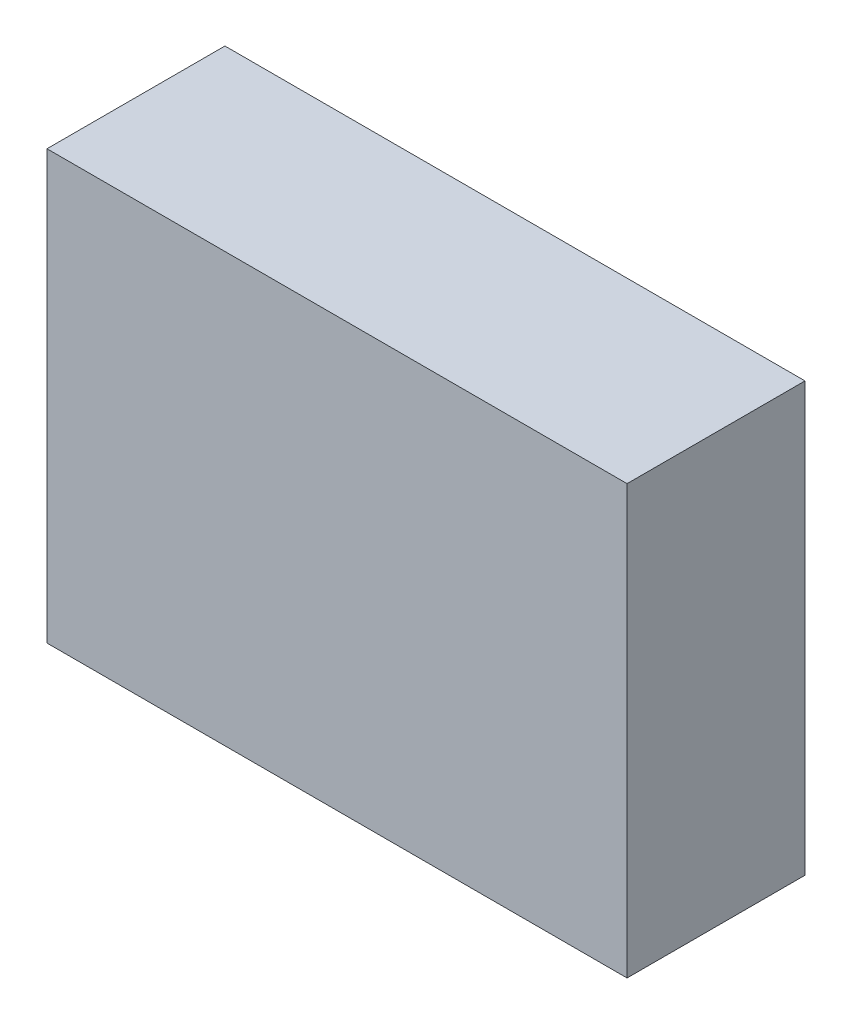
ISO-10303-21;
HEADER;
FILE_DESCRIPTION(('STEP AP214'),'2;1');
FILE_NAME('part.step','',(''),(''),'','','');
FILE_SCHEMA(('AUTOMOTIVE_DESIGN { 1 0 10303 214 1 1 1 1 }'));
ENDSEC;
DATA;
#1=APPLICATION_CONTEXT('core data for automotive mechanical design processes');
#2=APPLICATION_PROTOCOL_DEFINITION('international standard','automotive_design',2000,#1);
#3=PRODUCT_CONTEXT('',#1,'mechanical');
#4=PRODUCT('Part','Part','',(#3));
#5=PRODUCT_RELATED_PRODUCT_CATEGORY('part','',(#4));
#6=PRODUCT_DEFINITION_FORMATION('','',#4);
#7=PRODUCT_DEFINITION_CONTEXT('part definition',#1,'design');
#8=PRODUCT_DEFINITION('design','',#6,#7);
#9=PRODUCT_DEFINITION_SHAPE('','',#8);
#10=(LENGTH_UNIT() NAMED_UNIT(*) SI_UNIT(.MILLI.,.METRE.));
#11=(NAMED_UNIT(*) PLANE_ANGLE_UNIT() SI_UNIT($,.RADIAN.));
#12=(NAMED_UNIT(*) SI_UNIT($,.STERADIAN.) SOLID_ANGLE_UNIT());
#13=UNCERTAINTY_MEASURE_WITH_UNIT(LENGTH_MEASURE(1.E-05),#10,'distance_accuracy_value','');
#14=(GEOMETRIC_REPRESENTATION_CONTEXT(3) GLOBAL_UNCERTAINTY_ASSIGNED_CONTEXT((#13)) GLOBAL_UNIT_ASSIGNED_CONTEXT((#10,
#11,#12)) REPRESENTATION_CONTEXT('',''));
#15=CARTESIAN_POINT('',(0.,0.,0.));
#16=DIRECTION('',(0.,0.,1.));
#17=DIRECTION('',(1.,0.,0.));
#18=AXIS2_PLACEMENT_3D('',#15,#16,#17);
#19=CARTESIAN_POINT('',(-0.37260022,-0.27500072,0.2286));
#20=DIRECTION('',(0.,0.,-1.));
#21=DIRECTION('',(-1.,0.,0.));
#22=AXIS2_PLACEMENT_3D('',#19,#20,#21);
#23=PLANE('',#22);
#24=DIRECTION('',(0.,1.,0.));
#25=VECTOR('',#24,1.);
#26=CARTESIAN_POINT('',(0.37260276,-0.27500072,0.2286));
#27=LINE('',#26,#25);
#28=CARTESIAN_POINT('',(0.37260276,-0.27500072,0.2286));
#29=VERTEX_POINT('',#28);
#30=CARTESIAN_POINT('',(0.37260276,0.27500199,0.2286));
#31=VERTEX_POINT('',#30);
#32=EDGE_CURVE('E55',#29,#31,#27,.T.);
#33=ORIENTED_EDGE('',*,*,#32,.T.);
#34=DIRECTION('',(0.999999999994191,3.40846731045565E-06,0.));
#35=VECTOR('',#34,1.);
#36=CARTESIAN_POINT('',(0.37260276,0.27500326,0.2286));
#37=LINE('',#36,#35);
#38=CARTESIAN_POINT('',(-0.37260022,0.275000720000001,0.2286));
#39=VERTEX_POINT('',#38);
#40=EDGE_CURVE('E57',#31,#39,#37,.F.);
#41=ORIENTED_EDGE('',*,*,#40,.T.);
#42=DIRECTION('',(0.,1.,0.));
#43=VECTOR('',#42,1.);
#44=CARTESIAN_POINT('',(-0.37260022,0.27500072,0.2286));
#45=LINE('',#44,#43);
#46=CARTESIAN_POINT('',(-0.37260022,-0.27500072,0.2286));
#47=VERTEX_POINT('',#46);
#48=EDGE_CURVE('E20',#39,#47,#45,.F.);
#49=ORIENTED_EDGE('',*,*,#48,.T.);
#50=DIRECTION('',(1.,0.,0.));
#51=VECTOR('',#50,1.);
#52=CARTESIAN_POINT('',(-0.37260022,-0.27500072,0.2286));
#53=LINE('',#52,#51);
#54=EDGE_CURVE('E80',#47,#29,#53,.T.);
#55=ORIENTED_EDGE('',*,*,#54,.T.);
#56=EDGE_LOOP('',(#33,#41,#49,#55));
#57=FACE_BOUND('',#56,.T.);
#58=ADVANCED_FACE('F17',(#57),#23,.F.);
#59=CARTESIAN_POINT('',(-0.37260022,0.27500072,0.));
#60=DIRECTION('',(1.,0.,0.));
#61=DIRECTION('',(0.,0.,-1.));
#62=AXIS2_PLACEMENT_3D('',#59,#60,#61);
#63=PLANE('',#62);
#64=DIRECTION('',(0.,0.,1.));
#65=VECTOR('',#64,1.);
#66=CARTESIAN_POINT('',(-0.37260022,-0.27500072,0.));
#67=LINE('',#66,#65);
#68=CARTESIAN_POINT('',(-0.37260022,-0.27500072,0.));
#69=VERTEX_POINT('',#68);
#70=EDGE_CURVE('E68',#69,#47,#67,.T.);
#71=ORIENTED_EDGE('',*,*,#70,.T.);
#72=ORIENTED_EDGE('',*,*,#48,.F.);
#73=DIRECTION('',(0.,0.,1.));
#74=VECTOR('',#73,1.);
#75=CARTESIAN_POINT('',(-0.37260022,0.275000720000003,0.));
#76=LINE('',#75,#74);
#77=CARTESIAN_POINT('',(-0.37260022,0.275000720000001,0.));
#78=VERTEX_POINT('',#77);
#79=EDGE_CURVE('E63',#39,#78,#76,.F.);
#80=ORIENTED_EDGE('',*,*,#79,.T.);
#81=DIRECTION('',(0.,1.,0.));
#82=VECTOR('',#81,1.);
#83=CARTESIAN_POINT('',(-0.37260022,-0.27500072,0.));
#84=LINE('',#83,#82);
#85=EDGE_CURVE('E83',#69,#78,#84,.T.);
#86=ORIENTED_EDGE('',*,*,#85,.F.);
#87=EDGE_LOOP('',(#71,#72,#80,#86));
#88=FACE_BOUND('',#87,.T.);
#89=ADVANCED_FACE('F65',(#88),#63,.F.);
#90=CARTESIAN_POINT('',(0.37260276,0.27500326,0.));
#91=DIRECTION('',(3.40846731045565E-06,-0.999999999994191,0.));
#92=DIRECTION('',(0.999999999994191,3.40846731045565E-06,0.));
#93=AXIS2_PLACEMENT_3D('',#90,#91,#92);
#94=PLANE('',#93);
#95=ORIENTED_EDGE('',*,*,#79,.F.);
#96=ORIENTED_EDGE('',*,*,#40,.F.);
#97=DIRECTION('',(0.,0.,1.));
#98=VECTOR('',#97,1.);
#99=CARTESIAN_POINT('',(0.37260276,0.27500326,0.));
#100=LINE('',#99,#98);
#101=CARTESIAN_POINT('',(0.37260276,0.275002625,0.));
#102=VERTEX_POINT('',#101);
#103=EDGE_CURVE('E75',#31,#102,#100,.F.);
#104=ORIENTED_EDGE('',*,*,#103,.T.);
#105=DIRECTION('',(-1.,0.,0.));
#106=VECTOR('',#105,1.);
#107=CARTESIAN_POINT('',(-0.37260022,0.27500072,0.));
#108=LINE('',#107,#106);
#109=EDGE_CURVE('E72',#78,#102,#108,.F.);
#110=ORIENTED_EDGE('',*,*,#109,.F.);
#111=EDGE_LOOP('',(#95,#96,#104,#110));
#112=FACE_BOUND('',#111,.T.);
#113=ADVANCED_FACE('F70',(#112),#94,.F.);
#114=CARTESIAN_POINT('',(0.37260276,-0.27500072,0.));
#115=DIRECTION('',(-1.,0.,0.));
#116=DIRECTION('',(0.,0.,1.));
#117=AXIS2_PLACEMENT_3D('',#114,#115,#116);
#118=PLANE('',#117);
#119=ORIENTED_EDGE('',*,*,#103,.F.);
#120=ORIENTED_EDGE('',*,*,#32,.F.);
#121=DIRECTION('',(0.,0.,1.));
#122=VECTOR('',#121,1.);
#123=CARTESIAN_POINT('',(0.37260276,-0.27500072,0.));
#124=LINE('',#123,#122);
#125=CARTESIAN_POINT('',(0.37260276,-0.27500072,0.));
#126=VERTEX_POINT('',#125);
#127=EDGE_CURVE('E35',#29,#126,#124,.F.);
#128=ORIENTED_EDGE('',*,*,#127,.T.);
#129=DIRECTION('',(0.,1.,0.));
#130=VECTOR('',#129,1.);
#131=CARTESIAN_POINT('',(0.37260276,-0.27500072,0.));
#132=LINE('',#131,#130);
#133=EDGE_CURVE('E26',#102,#126,#132,.F.);
#134=ORIENTED_EDGE('',*,*,#133,.F.);
#135=EDGE_LOOP('',(#119,#120,#128,#134));
#136=FACE_BOUND('',#135,.T.);
#137=ADVANCED_FACE('F89',(#136),#118,.F.);
#138=CARTESIAN_POINT('',(-0.37260022,-0.27500072,0.));
#139=DIRECTION('',(0.,1.,0.));
#140=DIRECTION('',(0.,0.,1.));
#141=AXIS2_PLACEMENT_3D('',#138,#139,#140);
#142=PLANE('',#141);
#143=ORIENTED_EDGE('',*,*,#127,.F.);
#144=ORIENTED_EDGE('',*,*,#54,.F.);
#145=ORIENTED_EDGE('',*,*,#70,.F.);
#146=DIRECTION('',(-1.,0.,0.));
#147=VECTOR('',#146,1.);
#148=CARTESIAN_POINT('',(-0.37260022,-0.27500072,0.));
#149=LINE('',#148,#147);
#150=EDGE_CURVE('E11',#126,#69,#149,.T.);
#151=ORIENTED_EDGE('',*,*,#150,.F.);
#152=EDGE_LOOP('',(#143,#144,#145,#151));
#153=FACE_BOUND('',#152,.T.);
#154=ADVANCED_FACE('F91',(#153),#142,.F.);
#155=CARTESIAN_POINT('',(-0.37260022,-0.27500072,0.));
#156=DIRECTION('',(0.,0.,-1.));
#157=DIRECTION('',(-1.,0.,0.));
#158=AXIS2_PLACEMENT_3D('',#155,#156,#157);
#159=PLANE('',#158);
#160=ORIENTED_EDGE('',*,*,#133,.T.);
#161=ORIENTED_EDGE('',*,*,#150,.T.);
#162=ORIENTED_EDGE('',*,*,#85,.T.);
#163=ORIENTED_EDGE('',*,*,#109,.T.);
#164=EDGE_LOOP('',(#160,#161,#162,#163));
#165=FACE_BOUND('',#164,.T.);
#166=ADVANCED_FACE('F88',(#165),#159,.T.);
#167=CLOSED_SHELL('',(#58,#89,#113,#137,#154,#166));
#168=MANIFOLD_SOLID_BREP('B1',#167);
#169=ADVANCED_BREP_SHAPE_REPRESENTATION('',(#18,#168),#14);
#170=SHAPE_DEFINITION_REPRESENTATION(#9,#169);
ENDSEC;
END-ISO-10303-21;
